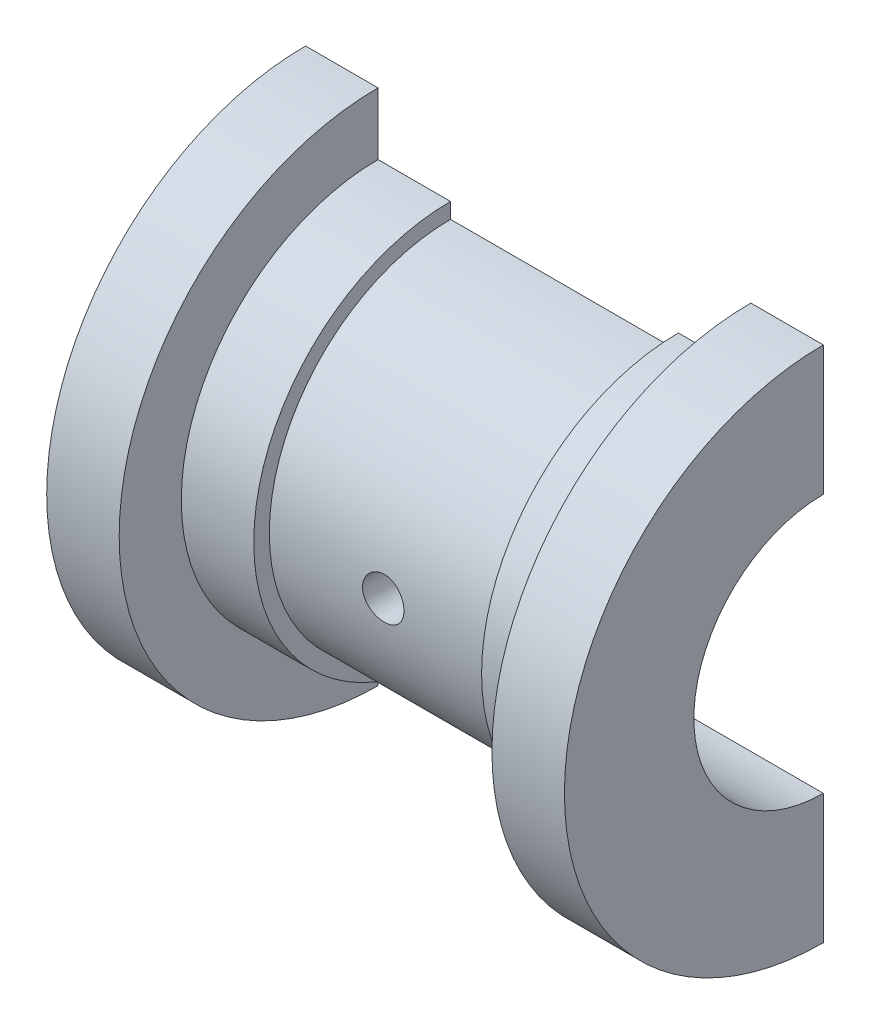
ISO-10303-21;
HEADER;
FILE_DESCRIPTION(('STEP AP214'),'2;1');
FILE_NAME('part.step','',(''),(''),'','','');
FILE_SCHEMA(('AUTOMOTIVE_DESIGN { 1 0 10303 214 1 1 1 1 }'));
ENDSEC;
DATA;
#1=APPLICATION_CONTEXT('core data for automotive mechanical design processes');
#2=APPLICATION_PROTOCOL_DEFINITION('international standard','automotive_design',2000,#1);
#3=PRODUCT_CONTEXT('',#1,'mechanical');
#4=PRODUCT('Part','Part','',(#3));
#5=PRODUCT_RELATED_PRODUCT_CATEGORY('part','',(#4));
#6=PRODUCT_DEFINITION_FORMATION('','',#4);
#7=PRODUCT_DEFINITION_CONTEXT('part definition',#1,'design');
#8=PRODUCT_DEFINITION('design','',#6,#7);
#9=PRODUCT_DEFINITION_SHAPE('','',#8);
#10=(LENGTH_UNIT() NAMED_UNIT(*) SI_UNIT(.MILLI.,.METRE.));
#11=(NAMED_UNIT(*) PLANE_ANGLE_UNIT() SI_UNIT($,.RADIAN.));
#12=(NAMED_UNIT(*) SI_UNIT($,.STERADIAN.) SOLID_ANGLE_UNIT());
#13=UNCERTAINTY_MEASURE_WITH_UNIT(LENGTH_MEASURE(1.E-05),#10,'distance_accuracy_value','');
#14=(GEOMETRIC_REPRESENTATION_CONTEXT(3) GLOBAL_UNCERTAINTY_ASSIGNED_CONTEXT((#13)) GLOBAL_UNIT_ASSIGNED_CONTEXT((#10,
#11,#12)) REPRESENTATION_CONTEXT('',''));
#15=CARTESIAN_POINT('',(0.,0.,0.));
#16=DIRECTION('',(0.,0.,1.));
#17=DIRECTION('',(1.,0.,0.));
#18=AXIS2_PLACEMENT_3D('',#15,#16,#17);
#19=CARTESIAN_POINT('',(-38.9493607052265,0.,0.));
#20=DIRECTION('',(-1.,0.,0.));
#21=DIRECTION('',(0.,-1.,0.));
#22=AXIS2_PLACEMENT_3D('',#19,#20,#21);
#23=CYLINDRICAL_SURFACE('',#22,17.5);
#24=CARTESIAN_POINT('',(11.,0.,0.));
#25=DIRECTION('',(-1.,0.,0.));
#26=DIRECTION('',(0.,-1.,0.));
#27=AXIS2_PLACEMENT_3D('',#24,#25,#26);
#28=CIRCLE('',#27,17.5);
#29=CARTESIAN_POINT('',(11.,-17.5,-1.2220184685951E-13));
#30=VERTEX_POINT('',#29);
#31=CARTESIAN_POINT('',(11.,17.5,0.));
#32=VERTEX_POINT('',#31);
#33=EDGE_CURVE('E187',#30,#32,#28,.T.);
#34=ORIENTED_EDGE('',*,*,#33,.T.);
#35=DIRECTION('',(-1.,0.,0.));
#36=VECTOR('',#35,1.);
#37=CARTESIAN_POINT('',(-11.,17.5,0.));
#38=LINE('',#37,#36);
#39=CARTESIAN_POINT('',(-11.,17.5,0.));
#40=VERTEX_POINT('',#39);
#41=EDGE_CURVE('E213',#32,#40,#38,.T.);
#42=ORIENTED_EDGE('',*,*,#41,.T.);
#43=CARTESIAN_POINT('',(-11.,0.,0.));
#44=DIRECTION('',(-1.,0.,0.));
#45=DIRECTION('',(0.,-1.,0.));
#46=AXIS2_PLACEMENT_3D('',#43,#44,#45);
#47=CIRCLE('',#46,17.5);
#48=CARTESIAN_POINT('',(-11.,-17.5,-1.2220184685951E-13));
#49=VERTEX_POINT('',#48);
#50=EDGE_CURVE('E189',#49,#40,#47,.T.);
#51=ORIENTED_EDGE('',*,*,#50,.F.);
#52=DIRECTION('',(-1.,0.,0.));
#53=VECTOR('',#52,1.);
#54=CARTESIAN_POINT('',(-11.,-17.5,-1.2220184685951E-13));
#55=LINE('',#54,#53);
#56=EDGE_CURVE('E165',#30,#49,#55,.T.);
#57=ORIENTED_EDGE('',*,*,#56,.F.);
#58=EDGE_LOOP('',(#34,#42,#51,#57));
#59=FACE_BOUND('',#58,.T.);
#60=CARTESIAN_POINT('',(0.,-2.00000000000012,17.3853386507137));
#61=CARTESIAN_POINT('',(0.111946589372524,-1.99999519733607,17.3853401353315));
#62=CARTESIAN_POINT('',(0.223964994921923,-1.99056928251654,17.3864315751054));
#63=CARTESIAN_POINT('',(0.444889671697474,-1.95311344773108,17.3906782331753));
#64=CARTESIAN_POINT('',(0.553792479503965,-1.92506360351956,17.3938356616542));
#65=CARTESIAN_POINT('',(0.765255030279527,-1.85119296589638,17.4018520931882));
#66=CARTESIAN_POINT('',(0.867818819285595,-1.80538364660721,17.4067099973959));
#67=CARTESIAN_POINT('',(1.06378206604588,-1.69731788496022,17.4175786814491));
#68=CARTESIAN_POINT('',(1.15718320126785,-1.63506446086883,17.423589249671));
#69=CARTESIAN_POINT('',(1.33262956371172,-1.49556368835398,17.4361176819346));
#70=CARTESIAN_POINT('',(1.41462552791579,-1.41825455823821,17.4426375676046));
#71=CARTESIAN_POINT('',(1.56450902249383,-1.2509695482429,17.4554317583341));
#72=CARTESIAN_POINT('',(1.63239587710581,-1.16099306200083,17.4617060516192));
#73=CARTESIAN_POINT('',(1.75230824059131,-0.970620910263756,17.4733225280882));
#74=CARTESIAN_POINT('',(1.80428955803743,-0.870197236204839,17.4786620969871));
#75=CARTESIAN_POINT('',(1.89063240605875,-0.661974973210041,17.4877853680334));
#76=CARTESIAN_POINT('',(1.9249944880326,-0.554176615186537,17.4915691188697));
#77=CARTESIAN_POINT('',(1.97497734252851,-0.334766558288145,17.4971402074225));
#78=CARTESIAN_POINT('',(1.99067964857446,-0.22317365719472,17.4989362281041));
#79=CARTESIAN_POINT('',(2.00314972142082,0.00107691382543691,17.5003590938998));
#80=CARTESIAN_POINT('',(1.99991811760643,0.113734548234908,17.4999860111176));
#81=CARTESIAN_POINT('',(1.9746778272773,0.336362487849558,17.497119767547));
#82=CARTESIAN_POINT('',(1.95275682041612,0.446342879003147,17.4946365066491));
#83=CARTESIAN_POINT('',(1.89089682950376,0.661053445479663,17.487840154992));
#84=CARTESIAN_POINT('',(1.85095755129325,0.765783535057179,17.4835270343592));
#85=CARTESIAN_POINT('',(1.75410019097594,0.967294288035632,17.4735386514763));
#86=CARTESIAN_POINT('',(1.69714377600709,1.06405636819033,17.4678603196472));
#87=CARTESIAN_POINT('',(1.56789678444337,1.2466816391767,17.4557776619181));
#88=CARTESIAN_POINT('',(1.49560561983236,1.33254441186891,17.449373308183));
#89=CARTESIAN_POINT('',(1.33724919448781,1.49144815236592,17.436513040988));
#90=CARTESIAN_POINT('',(1.25110758210007,1.56441304576833,17.4300570420279));
#91=CARTESIAN_POINT('',(1.0677588923309,1.69485961446726,17.4178574111694));
#92=CARTESIAN_POINT('',(0.970551789715113,1.7523412544539,17.4121137808956));
#93=CARTESIAN_POINT('',(0.767767939743451,1.85019181534937,17.4019890438088));
#94=CARTESIAN_POINT('',(0.662188535919723,1.89055527879392,17.3976083716403));
#95=CARTESIAN_POINT('',(0.445689423466888,1.95295957446176,17.3907142897617));
#96=CARTESIAN_POINT('',(0.334769928945009,1.97500114064263,17.3882008052542));
#97=CARTESIAN_POINT('',(0.111409276007052,2.00003653434772,17.3853390699854));
#98=CARTESIAN_POINT('',(-0.00101976549901365,2.00313713351242,17.384978682311));
#99=CARTESIAN_POINT('',(-0.224795725911944,1.99048370024856,17.3864318824203));
#100=CARTESIAN_POINT('',(-0.336142663982754,1.97473000234344,17.3882454316329));
#101=CARTESIAN_POINT('',(-0.554277710431836,1.92490480743112,17.3938311078367));
#102=CARTESIAN_POINT('',(-0.661077653557209,1.89088445720899,17.3975977651037));
#103=CARTESIAN_POINT('',(-0.867456208856069,1.80554412069028,17.4066608217964));
#104=CARTESIAN_POINT('',(-0.96703460698983,1.75422362188817,17.4119572665405));
#105=CARTESIAN_POINT('',(-1.15662812006314,1.63547501760183,17.4235123453982));
#106=CARTESIAN_POINT('',(-1.24659891285623,1.56797655870478,17.4297751382952));
#107=CARTESIAN_POINT('',(-1.41397230825862,1.41888814821172,17.442543959092));
#108=CARTESIAN_POINT('',(-1.49137450327603,1.33729773979944,17.4490499948718));
#109=CARTESIAN_POINT('',(-1.63178548317454,1.16187651855529,17.4616092377758));
#110=CARTESIAN_POINT('',(-1.69472433770165,1.0679895447053,17.4676601534551));
#111=CARTESIAN_POINT('',(-1.80393937919364,0.870915351390238,17.4785935486018));
#112=CARTESIAN_POINT('',(-1.8502158540187,0.767728292632447,17.4834760482544));
#113=CARTESIAN_POINT('',(-1.92467566123987,0.555220730050587,17.4915122431867));
#114=CARTESIAN_POINT('',(-1.95290023506191,0.445914831710572,17.4946698766728));
#115=CARTESIAN_POINT('',(-1.99058941951927,0.224077216219246,17.498916830849));
#116=CARTESIAN_POINT('',(-2.00005473054384,0.111545619660616,17.5000062287579));
#117=CARTESIAN_POINT('',(-1.99994510250234,-0.112864401253256,17.4999937520126));
#118=CARTESIAN_POINT('',(-1.99047832045056,-0.224742894695173,17.4989043247502));
#119=CARTESIAN_POINT('',(-1.95300127134245,-0.445308378800977,17.4946812487719));
#120=CARTESIAN_POINT('',(-1.92499100344009,-0.553995369319257,17.4915475999627));
#121=CARTESIAN_POINT('',(-1.85125428527817,-0.765084431079367,17.4835868311737));
#122=CARTESIAN_POINT('',(-1.80553211653411,-0.867488014290848,17.478760120486));
#123=CARTESIAN_POINT('',(-1.69768073352085,-1.06318537269573,17.4679493137143));
#124=CARTESIAN_POINT('',(-1.63555145524283,-1.15647911234707,17.4619652131149));
#125=CARTESIAN_POINT('',(-1.49624648821104,-1.33186210611065,17.4494678477128));
#126=CARTESIAN_POINT('',(-1.41899021819487,-1.41388716420701,17.4429518630307));
#127=CARTESIAN_POINT('',(-1.25178901681435,-1.56385330094132,17.4301475365176));
#128=CARTESIAN_POINT('',(-1.16184106815131,-1.63179102096634,17.4238592492668));
#129=CARTESIAN_POINT('',(-0.971480376349263,-1.75183717616211,17.4122005213082));
#130=CARTESIAN_POINT('',(-0.871034600637649,-1.80389349456606,17.4068331273112));
#131=CARTESIAN_POINT('',(-0.662825662631923,-1.89032803888989,17.3976597913728));
#132=CARTESIAN_POINT('',(-0.555070743865214,-1.92472581745891,17.3938521233529));
#133=CARTESIAN_POINT('',(-0.372277873121076,-1.96647476380533,17.3891702575432));
#134=CARTESIAN_POINT('',(-0.298400454831266,-1.97902906202822,17.3877403947785));
#135=CARTESIAN_POINT('',(-0.149692726088288,-1.99579326119787,17.3858240977585));
#136=CARTESIAN_POINT('',(-0.0748624212969904,-2.00000321170189,17.3853376579002));
#137=CARTESIAN_POINT('',(0.,-2.00000000000012,17.3853386507137));
#138=B_SPLINE_CURVE_WITH_KNOTS('',3,(#60,#61,#62,#63,#64,#65,#66,#67,#68,#69,#70,#71,#72,#73,
#74,#75,#76,#77,#78,#79,#80,#81,#82,#83,#84,#85,#86,#87,#88,#89,#90,#91,#92,#93,#94,#95,#96,#97,
#98,#99,#100,#101,#102,#103,#104,#105,#106,#107,#108,#109,#110,#111,#112,#113,#114,#115,#116,
#117,#118,#119,#120,#121,#122,#123,#124,#125,#126,#127,#128,#129,#130,#131,#132,#133,#134,#135,
#136,#137),.UNSPECIFIED.,.T.,.F.,(4,2,2,2,2,2,2,2,2,2,2,2,2,2,2,2,2,2,2,2,2,2,2,2,2,2,2,2,2,2,2,
2,2,2,2,2,2,2,4),(0.,0.335566330669862,0.671492236482426,1.00720146648589,1.34284912082551,
1.67990430025881,2.01697561937899,2.35497511648652,2.69296403516427,3.02947062308711,
3.36596602520247,3.70089142156129,4.03582228598058,4.3715133792636,4.70721734706225,
5.04483970261994,5.3824628281258,5.72019351085555,6.05791066376697,6.39372230997641,
6.72952799811684,7.06439829362762,7.3992785103225,7.73564232927687,8.07201705412561,
8.40998545131677,8.74794800946722,9.08513567305446,9.42231074728433,9.75756507912587,
10.0928194262631,10.4279927825518,10.7631674464669,11.1001786972192,11.4372702038874,
11.7754563049136,12.113267132881,12.3376728727777,12.5620772799195),.UNSPECIFIED.);
#139=CARTESIAN_POINT('',(0.,-2.00000000000012,17.3853386507137));
#140=VERTEX_POINT('',#139);
#141=EDGE_CURVE('E227',#140,#140,#138,.T.);
#142=ORIENTED_EDGE('',*,*,#141,.F.);
#143=EDGE_LOOP('',(#142));
#144=FACE_BOUND('',#143,.T.);
#145=ADVANCED_FACE('F33',(#59,#144),#23,.T.);
#146=CARTESIAN_POINT('',(25.,0.,0.));
#147=DIRECTION('',(-1.,0.,0.));
#148=DIRECTION('',(0.,-1.,0.));
#149=AXIS2_PLACEMENT_3D('',#146,#147,#148);
#150=CYLINDRICAL_SURFACE('',#149,12.5);
#151=CARTESIAN_POINT('',(-25.,0.,0.));
#152=DIRECTION('',(-1.,0.,0.));
#153=DIRECTION('',(0.,-1.,0.));
#154=AXIS2_PLACEMENT_3D('',#151,#152,#153);
#155=CIRCLE('',#154,12.5);
#156=CARTESIAN_POINT('',(-25.,-12.5,-1.74574066942157E-13));
#157=VERTEX_POINT('',#156);
#158=CARTESIAN_POINT('',(-25.,12.5,-1.74574066942157E-13));
#159=VERTEX_POINT('',#158);
#160=EDGE_CURVE('E129',#157,#159,#155,.T.);
#161=ORIENTED_EDGE('',*,*,#160,.T.);
#162=DIRECTION('',(-1.,0.,0.));
#163=VECTOR('',#162,1.);
#164=CARTESIAN_POINT('',(25.,12.5,-1.74574066942157E-13));
#165=LINE('',#164,#163);
#166=CARTESIAN_POINT('',(25.,12.5,-1.74574066942157E-13));
#167=VERTEX_POINT('',#166);
#168=EDGE_CURVE('E125',#167,#159,#165,.T.);
#169=ORIENTED_EDGE('',*,*,#168,.F.);
#170=CARTESIAN_POINT('',(25.,0.,0.));
#171=DIRECTION('',(-1.,0.,0.));
#172=DIRECTION('',(0.,-1.,0.));
#173=AXIS2_PLACEMENT_3D('',#170,#171,#172);
#174=CIRCLE('',#173,12.5);
#175=CARTESIAN_POINT('',(25.,-12.5,0.));
#176=VERTEX_POINT('',#175);
#177=EDGE_CURVE('E53',#176,#167,#174,.T.);
#178=ORIENTED_EDGE('',*,*,#177,.F.);
#179=DIRECTION('',(-1.,0.,0.));
#180=VECTOR('',#179,1.);
#181=CARTESIAN_POINT('',(25.,-12.5,-1.74574066942157E-13));
#182=LINE('',#181,#180);
#183=EDGE_CURVE('E133',#176,#157,#182,.T.);
#184=ORIENTED_EDGE('',*,*,#183,.T.);
#185=EDGE_LOOP('',(#161,#169,#178,#184));
#186=FACE_BOUND('',#185,.T.);
#187=CARTESIAN_POINT('',(0.,-2.00000000000009,12.3389626792531));
#188=CARTESIAN_POINT('',(-0.1115667153696,-1.99999546268278,12.3389646365747));
#189=CARTESIAN_POINT('',(-0.223195940876381,-1.9906330552036,12.3404922170901));
#190=CARTESIAN_POINT('',(-0.443326847344627,-1.95344445500893,12.3464325117521));
#191=CARTESIAN_POINT('',(-0.551825474504615,-1.92560083020003,12.3508479497636));
#192=CARTESIAN_POINT('',(-0.762477313101267,-1.85230972937135,12.3620513503607));
#193=CARTESIAN_POINT('',(-0.864635571645263,-1.80687646925898,12.3688373965941));
#194=CARTESIAN_POINT('',(-1.05986648038844,-1.69973041648439,12.3840151290006));
#195=CARTESIAN_POINT('',(-1.15294024493589,-1.63801962395051,12.3924066178675));
#196=CARTESIAN_POINT('',(-1.32821893279529,-1.49947140236488,12.409935008592));
#197=CARTESIAN_POINT('',(-1.41032926550982,-1.42251498707593,12.4190774196954));
#198=CARTESIAN_POINT('',(-1.56052945966013,-1.2559170981524,12.4370285016078));
#199=CARTESIAN_POINT('',(-1.62861851530075,-1.16627489597177,12.4458371532121));
#200=CARTESIAN_POINT('',(-1.7491959612917,-0.976239917029404,12.4621862608067));
#201=CARTESIAN_POINT('',(-1.80159669033811,-0.875790844473932,12.4697194921289));
#202=CARTESIAN_POINT('',(-1.88874693905998,-0.667375995891046,12.4826077762261));
#203=CARTESIAN_POINT('',(-1.92349751749068,-0.559410671172552,12.4879629596488));
#204=CARTESIAN_POINT('',(-1.97407274436243,-0.340004128946155,12.4958528816707));
#205=CARTESIAN_POINT('',(-1.99005611940511,-0.228600363359494,12.49841126176));
#206=CARTESIAN_POINT('',(-2.00313650808571,-0.00466480752233918,12.500500461766));
#207=CARTESIAN_POINT('',(-2.00023470914493,0.107866911362923,12.5000314720312));
#208=CARTESIAN_POINT('',(-1.97575151431498,0.329779715978444,12.4961375614702));
#209=CARTESIAN_POINT('',(-1.95434091575268,0.439180187321327,12.4927396690852));
#210=CARTESIAN_POINT('',(-1.89371648537535,0.652815342747586,12.4833998597574));
#211=CARTESIAN_POINT('',(-1.85450214519059,0.757049879228094,12.4774578701704));
#212=CARTESIAN_POINT('',(-1.75921154129989,0.957905986408951,12.4636513003451));
#213=CARTESIAN_POINT('',(-1.70306427260419,1.05449329349375,12.4557786507463));
#214=CARTESIAN_POINT('',(-1.57555357138301,1.23693967157024,12.4389865614945));
#215=CARTESIAN_POINT('',(-1.50418900182922,1.32279794013338,12.4300670436423));
#216=CARTESIAN_POINT('',(-1.34732043643976,1.48235721573527,12.4120565702159));
#217=CARTESIAN_POINT('',(-1.2616672241591,1.55591150821591,12.4029648129688));
#218=CARTESIAN_POINT('',(-1.07915724372807,1.68762680827432,12.3857313850728));
#219=CARTESIAN_POINT('',(-0.982300387310595,1.74578769456438,12.3775897219102));
#220=CARTESIAN_POINT('',(-0.779969490042987,1.84509031627284,12.3631781549851));
#221=CARTESIAN_POINT('',(-0.674487164843649,1.8862154542191,12.3569100782548));
#222=CARTESIAN_POINT('',(-0.457989378356675,1.95012354011936,12.3469864391895));
#223=CARTESIAN_POINT('',(-0.346974364635672,1.97290796919502,12.343330665898));
#224=CARTESIAN_POINT('',(-0.123872177326533,1.9992834999762,12.3390860491727));
#225=CARTESIAN_POINT('',(-0.0118102853156295,2.00308326374912,12.338463865144));
#226=CARTESIAN_POINT('',(0.211348966265646,1.99193667548237,12.3402681873056));
#227=CARTESIAN_POINT('',(0.322446359912494,1.97699098847038,12.3426945853422));
#228=CARTESIAN_POINT('',(0.539866905444395,1.92895527704852,12.350291946998));
#229=CARTESIAN_POINT('',(0.646213923180768,1.89597053344232,12.3554469800097));
#230=CARTESIAN_POINT('',(0.85187038701668,1.81290306911347,12.3679074973821));
#231=CARTESIAN_POINT('',(0.951179441681865,1.76281939828996,12.3752131012361));
#232=CARTESIAN_POINT('',(1.14087239308146,1.64647965217404,12.3912295180301));
#233=CARTESIAN_POINT('',(1.23117295357006,1.58008930093847,12.3999517832886));
#234=CARTESIAN_POINT('',(1.39942606063674,1.43320604247686,12.4177848415153));
#235=CARTESIAN_POINT('',(1.47737780864004,1.35271222391408,12.426895659562));
#236=CARTESIAN_POINT('',(1.61947729209286,1.17898475488113,12.4445842082074));
#237=CARTESIAN_POINT('',(1.68348622911078,1.08563688229291,12.4531560233311));
#238=CARTESIAN_POINT('',(1.7949130459885,0.88939184738847,12.4687070996719));
#239=CARTESIAN_POINT('',(1.8423314293228,0.786494974976238,12.4756864092145));
#240=CARTESIAN_POINT('',(1.91901272401869,0.574493777094251,12.4872402999743));
#241=CARTESIAN_POINT('',(1.94834960623599,0.465416763098491,12.4918246669271));
#242=CARTESIAN_POINT('',(1.98827383639251,0.243805255219738,12.4981133908354));
#243=CARTESIAN_POINT('',(1.99886260115402,0.131271023257642,12.4998179654206));
#244=CARTESIAN_POINT('',(2.00095179807928,-0.0927181607457992,12.5001523384762));
#245=CARTESIAN_POINT('',(1.99266389940292,-0.204171144783063,12.4988162330541));
#246=CARTESIAN_POINT('',(1.95769116172815,-0.42407633113731,12.4932886224694));
#247=CARTESIAN_POINT('',(1.93100640664942,-0.532528547140343,12.4890971303321));
#248=CARTESIAN_POINT('',(1.86007617517217,-0.743282123113034,12.4783277894448));
#249=CARTESIAN_POINT('',(1.81584732795194,-0.845589202324763,12.471752200968));
#250=CARTESIAN_POINT('',(1.71110753962108,-1.04136319830558,12.4569342995936));
#251=CARTESIAN_POINT('',(1.65059592553781,-1.13482974947663,12.4486919178104));
#252=CARTESIAN_POINT('',(1.51425167961562,-1.3113388914684,12.4313454639236));
#253=CARTESIAN_POINT('',(1.4382634970135,-1.39426053318845,12.4222331866072));
#254=CARTESIAN_POINT('',(1.27345013113633,-1.54625119082771,12.4042323453373));
#255=CARTESIAN_POINT('',(1.18462194427879,-1.61531695647607,12.3953438343009));
#256=CARTESIAN_POINT('',(0.995970826081012,-1.7380419173616,12.3787350502446));
#257=CARTESIAN_POINT('',(0.896080549743533,-1.79159866107398,12.3710226983478));
#258=CARTESIAN_POINT('',(0.688641710336668,-1.88109182389782,12.35773272045));
#259=CARTESIAN_POINT('',(0.581101048458822,-1.91704612842104,12.3521529288763));
#260=CARTESIAN_POINT('',(0.394262041879368,-1.96235985662772,12.3450187006154));
#261=CARTESIAN_POINT('',(0.316104706528516,-1.97645270113696,12.3427600761638));
#262=CARTESIAN_POINT('',(0.158642105439383,-1.99527431170461,12.339731381368));
#263=CARTESIAN_POINT('',(0.0793368579618939,-2.00000322655827,12.3389612873707));
#264=CARTESIAN_POINT('',(0.,-2.00000000000009,12.3389626792531));
#265=B_SPLINE_CURVE_WITH_KNOTS('',3,(#187,#188,#189,#190,#191,#192,#193,#194,#195,#196,#197,
#198,#199,#200,#201,#202,#203,#204,#205,#206,#207,#208,#209,#210,#211,#212,#213,#214,#215,#216,
#217,#218,#219,#220,#221,#222,#223,#224,#225,#226,#227,#228,#229,#230,#231,#232,#233,#234,#235,
#236,#237,#238,#239,#240,#241,#242,#243,#244,#245,#246,#247,#248,#249,#250,#251,#252,#253,#254,
#255,#256,#257,#258,#259,#260,#261,#262,#263,#264),.UNSPECIFIED.,.T.,.F.,(4,2,2,2,2,2,2,2,2,2,2,
2,2,2,2,2,2,2,2,2,2,2,2,2,2,2,2,2,2,2,2,2,2,2,2,2,2,2,4),(0.,0.334410082462096,0.66913604063283,
1.00359203680449,1.33800695527949,1.6751426933581,2.01229780104021,2.35130309503299,
2.69028805118043,3.02638485112864,3.36246051891023,3.69546762348862,4.0284842373816,
4.36291718178071,4.69737512358616,5.03557384337791,5.37377522782556,5.71230534220323,
6.05080811551122,6.3855820633356,6.72034413480418,7.05317297710997,7.38602031604106,
7.7217061792982,8.05741374188327,8.39632425403564,8.73522448035856,9.07272891067331,
9.41020783420237,9.74392117047707,10.0776329844848,10.4110292424998,10.7444392820194,
11.0813822106389,11.4184040861632,11.7576040091322,12.0964585602663,12.3342666441618,
12.5720709491951),.UNSPECIFIED.);
#266=CARTESIAN_POINT('',(0.,-2.00000000000009,12.3389626792531));
#267=VERTEX_POINT('',#266);
#268=EDGE_CURVE('E37',#267,#267,#265,.T.);
#269=ORIENTED_EDGE('',*,*,#268,.F.);
#270=EDGE_LOOP('',(#269));
#271=FACE_BOUND('',#270,.T.);
#272=ADVANCED_FACE('F126',(#186,#271),#150,.F.);
#273=CARTESIAN_POINT('',(0.,0.,0.));
#274=DIRECTION('',(0.,0.,1.));
#275=DIRECTION('',(-1.,0.,0.));
#276=AXIS2_PLACEMENT_3D('',#273,#274,#275);
#277=PLANE('',#276);
#278=DIRECTION('',(0.,-1.,0.));
#279=VECTOR('',#278,1.);
#280=CARTESIAN_POINT('',(25.,0.,0.));
#281=LINE('',#280,#279);
#282=CARTESIAN_POINT('',(25.,25.,0.));
#283=VERTEX_POINT('',#282);
#284=EDGE_CURVE('E139',#283,#167,#281,.T.);
#285=ORIENTED_EDGE('',*,*,#284,.T.);
#286=ORIENTED_EDGE('',*,*,#168,.T.);
#287=DIRECTION('',(0.,1.,0.));
#288=VECTOR('',#287,1.);
#289=CARTESIAN_POINT('',(-25.,0.,0.));
#290=LINE('',#289,#288);
#291=CARTESIAN_POINT('',(-25.,25.,0.));
#292=VERTEX_POINT('',#291);
#293=EDGE_CURVE('E207',#159,#292,#290,.T.);
#294=ORIENTED_EDGE('',*,*,#293,.T.);
#295=DIRECTION('',(-1.,0.,0.));
#296=VECTOR('',#295,1.);
#297=CARTESIAN_POINT('',(-25.,25.,0.));
#298=LINE('',#297,#296);
#299=CARTESIAN_POINT('',(-18.,25.,0.));
#300=VERTEX_POINT('',#299);
#301=EDGE_CURVE('E197',#300,#292,#298,.T.);
#302=ORIENTED_EDGE('',*,*,#301,.F.);
#303=DIRECTION('',(0.,1.,0.));
#304=VECTOR('',#303,1.);
#305=CARTESIAN_POINT('',(-18.,25.,0.));
#306=LINE('',#305,#304);
#307=CARTESIAN_POINT('',(-18.,19.,0.));
#308=VERTEX_POINT('',#307);
#309=EDGE_CURVE('E201',#308,#300,#306,.T.);
#310=ORIENTED_EDGE('',*,*,#309,.F.);
#311=DIRECTION('',(-1.,0.,0.));
#312=VECTOR('',#311,1.);
#313=CARTESIAN_POINT('',(-18.,19.,0.));
#314=LINE('',#313,#312);
#315=CARTESIAN_POINT('',(-11.,19.,0.));
#316=VERTEX_POINT('',#315);
#317=EDGE_CURVE('E205',#316,#308,#314,.T.);
#318=ORIENTED_EDGE('',*,*,#317,.F.);
#319=DIRECTION('',(0.,1.,0.));
#320=VECTOR('',#319,1.);
#321=CARTESIAN_POINT('',(-11.,19.,0.));
#322=LINE('',#321,#320);
#323=EDGE_CURVE('E210',#40,#316,#322,.T.);
#324=ORIENTED_EDGE('',*,*,#323,.F.);
#325=ORIENTED_EDGE('',*,*,#41,.F.);
#326=DIRECTION('',(0.,-1.,0.));
#327=VECTOR('',#326,1.);
#328=CARTESIAN_POINT('',(11.,19.,0.));
#329=LINE('',#328,#327);
#330=CARTESIAN_POINT('',(11.,19.,0.));
#331=VERTEX_POINT('',#330);
#332=EDGE_CURVE('E216',#331,#32,#329,.T.);
#333=ORIENTED_EDGE('',*,*,#332,.F.);
#334=DIRECTION('',(-1.,0.,0.));
#335=VECTOR('',#334,1.);
#336=CARTESIAN_POINT('',(18.,19.,0.));
#337=LINE('',#336,#335);
#338=CARTESIAN_POINT('',(18.,19.,0.));
#339=VERTEX_POINT('',#338);
#340=EDGE_CURVE('E219',#339,#331,#337,.T.);
#341=ORIENTED_EDGE('',*,*,#340,.F.);
#342=DIRECTION('',(0.,-1.,0.));
#343=VECTOR('',#342,1.);
#344=CARTESIAN_POINT('',(18.,25.,0.));
#345=LINE('',#344,#343);
#346=CARTESIAN_POINT('',(18.,25.,0.));
#347=VERTEX_POINT('',#346);
#348=EDGE_CURVE('E222',#347,#339,#345,.T.);
#349=ORIENTED_EDGE('',*,*,#348,.F.);
#350=DIRECTION('',(-1.,0.,0.));
#351=VECTOR('',#350,1.);
#352=CARTESIAN_POINT('',(25.,25.,0.));
#353=LINE('',#352,#351);
#354=EDGE_CURVE('E147',#283,#347,#353,.T.);
#355=ORIENTED_EDGE('',*,*,#354,.F.);
#356=EDGE_LOOP('',(#285,#286,#294,#302,#310,#318,#324,#325,#333,#341,#349,#355));
#357=FACE_BOUND('',#356,.T.);
#358=ADVANCED_FACE('F144',(#357),#277,.F.);
#359=CARTESIAN_POINT('',(-25.,0.,0.));
#360=DIRECTION('',(1.,0.,0.));
#361=DIRECTION('',(0.,1.,0.));
#362=AXIS2_PLACEMENT_3D('',#359,#360,#361);
#363=PLANE('',#362);
#364=ORIENTED_EDGE('',*,*,#293,.F.);
#365=ORIENTED_EDGE('',*,*,#160,.F.);
#366=CARTESIAN_POINT('',(-25.,-25.,-1.74574066942157E-13));
#367=VERTEX_POINT('',#366);
#368=EDGE_CURVE('E153',#367,#157,#290,.T.);
#369=ORIENTED_EDGE('',*,*,#368,.F.);
#370=CARTESIAN_POINT('',(-25.,0.,0.));
#371=DIRECTION('',(-1.,0.,0.));
#372=DIRECTION('',(0.,-1.,0.));
#373=AXIS2_PLACEMENT_3D('',#370,#371,#372);
#374=CIRCLE('',#373,25.);
#375=EDGE_CURVE('E11',#367,#292,#374,.T.);
#376=ORIENTED_EDGE('',*,*,#375,.T.);
#377=EDGE_LOOP('',(#364,#365,#369,#376));
#378=FACE_BOUND('',#377,.T.);
#379=ADVANCED_FACE('F248',(#378),#363,.F.);
#380=CARTESIAN_POINT('',(-38.9493607052265,0.,0.));
#381=DIRECTION('',(-1.,0.,0.));
#382=DIRECTION('',(0.,-1.,0.));
#383=AXIS2_PLACEMENT_3D('',#380,#381,#382);
#384=CYLINDRICAL_SURFACE('',#383,25.);
#385=CARTESIAN_POINT('',(-18.,0.,0.));
#386=DIRECTION('',(-1.,0.,0.));
#387=DIRECTION('',(0.,-1.,0.));
#388=AXIS2_PLACEMENT_3D('',#385,#386,#387);
#389=CIRCLE('',#388,25.);
#390=CARTESIAN_POINT('',(-18.,-25.,-1.74574066942157E-13));
#391=VERTEX_POINT('',#390);
#392=EDGE_CURVE('E46',#391,#300,#389,.T.);
#393=ORIENTED_EDGE('',*,*,#392,.T.);
#394=ORIENTED_EDGE('',*,*,#301,.T.);
#395=ORIENTED_EDGE('',*,*,#375,.F.);
#396=DIRECTION('',(-1.,0.,0.));
#397=VECTOR('',#396,1.);
#398=CARTESIAN_POINT('',(-25.,-25.,-1.74574066942157E-13));
#399=LINE('',#398,#397);
#400=EDGE_CURVE('E177',#391,#367,#399,.T.);
#401=ORIENTED_EDGE('',*,*,#400,.F.);
#402=EDGE_LOOP('',(#393,#394,#395,#401));
#403=FACE_BOUND('',#402,.T.);
#404=ADVANCED_FACE('F35',(#403),#384,.T.);
#405=CARTESIAN_POINT('',(-18.,-25.,-1.74574066942157E-13));
#406=DIRECTION('',(-1.,0.,0.));
#407=DIRECTION('',(0.,-1.,0.));
#408=AXIS2_PLACEMENT_3D('',#405,#406,#407);
#409=PLANE('',#408);
#410=CARTESIAN_POINT('',(-18.,0.,0.));
#411=DIRECTION('',(-1.,0.,0.));
#412=DIRECTION('',(0.,-1.,0.));
#413=AXIS2_PLACEMENT_3D('',#410,#411,#412);
#414=CIRCLE('',#413,19.);
#415=CARTESIAN_POINT('',(-18.,-19.,-1.32676290876039E-13));
#416=VERTEX_POINT('',#415);
#417=EDGE_CURVE('E193',#416,#308,#414,.T.);
#418=ORIENTED_EDGE('',*,*,#417,.T.);
#419=ORIENTED_EDGE('',*,*,#309,.T.);
#420=ORIENTED_EDGE('',*,*,#392,.F.);
#421=DIRECTION('',(0.,-1.,0.));
#422=VECTOR('',#421,1.);
#423=CARTESIAN_POINT('',(-18.,-25.,-1.74574066942157E-13));
#424=LINE('',#423,#422);
#425=EDGE_CURVE('E174',#416,#391,#424,.T.);
#426=ORIENTED_EDGE('',*,*,#425,.F.);
#427=EDGE_LOOP('',(#418,#419,#420,#426));
#428=FACE_BOUND('',#427,.T.);
#429=ADVANCED_FACE('F202',(#428),#409,.F.);
#430=CARTESIAN_POINT('',(-38.9493607052265,0.,0.));
#431=DIRECTION('',(-1.,0.,0.));
#432=DIRECTION('',(0.,-1.,0.));
#433=AXIS2_PLACEMENT_3D('',#430,#431,#432);
#434=CYLINDRICAL_SURFACE('',#433,19.);
#435=CARTESIAN_POINT('',(-11.,0.,0.));
#436=DIRECTION('',(-1.,0.,0.));
#437=DIRECTION('',(0.,-1.,0.));
#438=AXIS2_PLACEMENT_3D('',#435,#436,#437);
#439=CIRCLE('',#438,19.);
#440=CARTESIAN_POINT('',(-11.,-19.,-1.32676290876039E-13));
#441=VERTEX_POINT('',#440);
#442=EDGE_CURVE('E191',#441,#316,#439,.T.);
#443=ORIENTED_EDGE('',*,*,#442,.T.);
#444=ORIENTED_EDGE('',*,*,#317,.T.);
#445=ORIENTED_EDGE('',*,*,#417,.F.);
#446=DIRECTION('',(-1.,0.,0.));
#447=VECTOR('',#446,1.);
#448=CARTESIAN_POINT('',(-18.,-19.,-1.32676290876039E-13));
#449=LINE('',#448,#447);
#450=EDGE_CURVE('E171',#441,#416,#449,.T.);
#451=ORIENTED_EDGE('',*,*,#450,.F.);
#452=EDGE_LOOP('',(#443,#444,#445,#451));
#453=FACE_BOUND('',#452,.T.);
#454=ADVANCED_FACE('F272',(#453),#434,.T.);
#455=CARTESIAN_POINT('',(-11.,-19.,-1.32676290876039E-13));
#456=DIRECTION('',(-1.,0.,0.));
#457=DIRECTION('',(0.,-1.,0.));
#458=AXIS2_PLACEMENT_3D('',#455,#456,#457);
#459=PLANE('',#458);
#460=ORIENTED_EDGE('',*,*,#50,.T.);
#461=ORIENTED_EDGE('',*,*,#323,.T.);
#462=ORIENTED_EDGE('',*,*,#442,.F.);
#463=DIRECTION('',(0.,-1.,0.));
#464=VECTOR('',#463,1.);
#465=CARTESIAN_POINT('',(-11.,-19.,-1.32676290876039E-13));
#466=LINE('',#465,#464);
#467=EDGE_CURVE('E168',#49,#441,#466,.T.);
#468=ORIENTED_EDGE('',*,*,#467,.F.);
#469=EDGE_LOOP('',(#460,#461,#462,#468));
#470=FACE_BOUND('',#469,.T.);
#471=ADVANCED_FACE('F267',(#470),#459,.F.);
#472=CARTESIAN_POINT('',(11.,-19.,-1.32676290876039E-13));
#473=DIRECTION('',(1.,0.,0.));
#474=DIRECTION('',(0.,1.,0.));
#475=AXIS2_PLACEMENT_3D('',#472,#473,#474);
#476=PLANE('',#475);
#477=CARTESIAN_POINT('',(11.,0.,0.));
#478=DIRECTION('',(-1.,0.,0.));
#479=DIRECTION('',(0.,-1.,0.));
#480=AXIS2_PLACEMENT_3D('',#477,#478,#479);
#481=CIRCLE('',#480,19.);
#482=CARTESIAN_POINT('',(11.,-19.,-1.32676290876039E-13));
#483=VERTEX_POINT('',#482);
#484=EDGE_CURVE('E185',#483,#331,#481,.T.);
#485=ORIENTED_EDGE('',*,*,#484,.T.);
#486=ORIENTED_EDGE('',*,*,#332,.T.);
#487=ORIENTED_EDGE('',*,*,#33,.F.);
#488=DIRECTION('',(0.,1.,0.));
#489=VECTOR('',#488,1.);
#490=CARTESIAN_POINT('',(11.,-19.,-1.32676290876039E-13));
#491=LINE('',#490,#489);
#492=EDGE_CURVE('E162',#483,#30,#491,.T.);
#493=ORIENTED_EDGE('',*,*,#492,.F.);
#494=EDGE_LOOP('',(#485,#486,#487,#493));
#495=FACE_BOUND('',#494,.T.);
#496=ADVANCED_FACE('F264',(#495),#476,.F.);
#497=CARTESIAN_POINT('',(-38.9493607052265,0.,0.));
#498=DIRECTION('',(-1.,0.,0.));
#499=DIRECTION('',(0.,-1.,0.));
#500=AXIS2_PLACEMENT_3D('',#497,#498,#499);
#501=CYLINDRICAL_SURFACE('',#500,19.);
#502=CARTESIAN_POINT('',(18.,0.,0.));
#503=DIRECTION('',(-1.,0.,0.));
#504=DIRECTION('',(0.,-1.,0.));
#505=AXIS2_PLACEMENT_3D('',#502,#503,#504);
#506=CIRCLE('',#505,19.);
#507=CARTESIAN_POINT('',(18.,-19.,-1.32676290876039E-13));
#508=VERTEX_POINT('',#507);
#509=EDGE_CURVE('E183',#508,#339,#506,.T.);
#510=ORIENTED_EDGE('',*,*,#509,.T.);
#511=ORIENTED_EDGE('',*,*,#340,.T.);
#512=ORIENTED_EDGE('',*,*,#484,.F.);
#513=DIRECTION('',(-1.,0.,0.));
#514=VECTOR('',#513,1.);
#515=CARTESIAN_POINT('',(18.,-19.,-1.32676290876039E-13));
#516=LINE('',#515,#514);
#517=EDGE_CURVE('E159',#508,#483,#516,.T.);
#518=ORIENTED_EDGE('',*,*,#517,.F.);
#519=EDGE_LOOP('',(#510,#511,#512,#518));
#520=FACE_BOUND('',#519,.T.);
#521=ADVANCED_FACE('F261',(#520),#501,.T.);
#522=CARTESIAN_POINT('',(18.,-25.,-1.74574066942157E-13));
#523=DIRECTION('',(1.,0.,0.));
#524=DIRECTION('',(0.,1.,0.));
#525=AXIS2_PLACEMENT_3D('',#522,#523,#524);
#526=PLANE('',#525);
#527=CARTESIAN_POINT('',(18.,0.,0.));
#528=DIRECTION('',(-1.,0.,0.));
#529=DIRECTION('',(0.,-1.,0.));
#530=AXIS2_PLACEMENT_3D('',#527,#528,#529);
#531=CIRCLE('',#530,25.);
#532=CARTESIAN_POINT('',(18.,-25.,-1.74574066942157E-13));
#533=VERTEX_POINT('',#532);
#534=EDGE_CURVE('E181',#533,#347,#531,.T.);
#535=ORIENTED_EDGE('',*,*,#534,.T.);
#536=ORIENTED_EDGE('',*,*,#348,.T.);
#537=ORIENTED_EDGE('',*,*,#509,.F.);
#538=DIRECTION('',(0.,1.,0.));
#539=VECTOR('',#538,1.);
#540=CARTESIAN_POINT('',(18.,-25.,-1.74574066942157E-13));
#541=LINE('',#540,#539);
#542=EDGE_CURVE('E151',#533,#508,#541,.T.);
#543=ORIENTED_EDGE('',*,*,#542,.F.);
#544=EDGE_LOOP('',(#535,#536,#537,#543));
#545=FACE_BOUND('',#544,.T.);
#546=ADVANCED_FACE('F257',(#545),#526,.F.);
#547=CARTESIAN_POINT('',(-38.9493607052265,0.,0.));
#548=DIRECTION('',(-1.,0.,0.));
#549=DIRECTION('',(0.,-1.,0.));
#550=AXIS2_PLACEMENT_3D('',#547,#548,#549);
#551=CYLINDRICAL_SURFACE('',#550,25.);
#552=CARTESIAN_POINT('',(25.,0.,0.));
#553=DIRECTION('',(-1.,0.,0.));
#554=DIRECTION('',(0.,-1.,0.));
#555=AXIS2_PLACEMENT_3D('',#552,#553,#554);
#556=CIRCLE('',#555,25.);
#557=CARTESIAN_POINT('',(25.,-25.,-1.74574066942157E-13));
#558=VERTEX_POINT('',#557);
#559=EDGE_CURVE('E179',#558,#283,#556,.T.);
#560=ORIENTED_EDGE('',*,*,#559,.T.);
#561=ORIENTED_EDGE('',*,*,#354,.T.);
#562=ORIENTED_EDGE('',*,*,#534,.F.);
#563=DIRECTION('',(-1.,0.,0.));
#564=VECTOR('',#563,1.);
#565=CARTESIAN_POINT('',(25.,-25.,-1.74574066942157E-13));
#566=LINE('',#565,#564);
#567=EDGE_CURVE('E148',#558,#533,#566,.T.);
#568=ORIENTED_EDGE('',*,*,#567,.F.);
#569=EDGE_LOOP('',(#560,#561,#562,#568));
#570=FACE_BOUND('',#569,.T.);
#571=ADVANCED_FACE('F254',(#570),#551,.T.);
#572=CARTESIAN_POINT('',(25.,0.,0.));
#573=DIRECTION('',(-1.,0.,0.));
#574=DIRECTION('',(0.,-1.,0.));
#575=AXIS2_PLACEMENT_3D('',#572,#573,#574);
#576=PLANE('',#575);
#577=EDGE_CURVE('E141',#176,#558,#281,.T.);
#578=ORIENTED_EDGE('',*,*,#577,.F.);
#579=ORIENTED_EDGE('',*,*,#177,.T.);
#580=ORIENTED_EDGE('',*,*,#284,.F.);
#581=ORIENTED_EDGE('',*,*,#559,.F.);
#582=EDGE_LOOP('',(#578,#579,#580,#581));
#583=FACE_BOUND('',#582,.T.);
#584=ADVANCED_FACE('F137',(#583),#576,.F.);
#585=ORIENTED_EDGE('',*,*,#368,.T.);
#586=ORIENTED_EDGE('',*,*,#183,.F.);
#587=ORIENTED_EDGE('',*,*,#577,.T.);
#588=ORIENTED_EDGE('',*,*,#567,.T.);
#589=ORIENTED_EDGE('',*,*,#542,.T.);
#590=ORIENTED_EDGE('',*,*,#517,.T.);
#591=ORIENTED_EDGE('',*,*,#492,.T.);
#592=ORIENTED_EDGE('',*,*,#56,.T.);
#593=ORIENTED_EDGE('',*,*,#467,.T.);
#594=ORIENTED_EDGE('',*,*,#450,.T.);
#595=ORIENTED_EDGE('',*,*,#425,.T.);
#596=ORIENTED_EDGE('',*,*,#400,.T.);
#597=EDGE_LOOP('',(#585,#586,#587,#588,#589,#590,#591,#592,#593,#594,#595,#596));
#598=FACE_BOUND('',#597,.T.);
#599=ADVANCED_FACE('F239',(#598),#277,.F.);
#600=CARTESIAN_POINT('',(0.,1.78065548281E-13,-25.5));
#601=DIRECTION('',(0.,0.,1.));
#602=DIRECTION('',(0.,-1.,0.));
#603=AXIS2_PLACEMENT_3D('',#600,#601,#602);
#604=CYLINDRICAL_SURFACE('',#603,2.);
#605=ORIENTED_EDGE('',*,*,#268,.T.);
#606=EDGE_LOOP('',(#605));
#607=FACE_BOUND('',#606,.T.);
#608=ORIENTED_EDGE('',*,*,#141,.T.);
#609=EDGE_LOOP('',(#608));
#610=FACE_BOUND('',#609,.T.);
#611=ADVANCED_FACE('F236',(#607,#610),#604,.F.);
#612=CLOSED_SHELL('',(#145,#272,#358,#379,#404,#429,#454,#471,#496,#521,#546,#571,#584,#599,#611));
#613=MANIFOLD_SOLID_BREP('B2',#612);
#614=ADVANCED_BREP_SHAPE_REPRESENTATION('',(#18,#613),#14);
#615=SHAPE_DEFINITION_REPRESENTATION(#9,#614);
ENDSEC;
END-ISO-10303-21;
